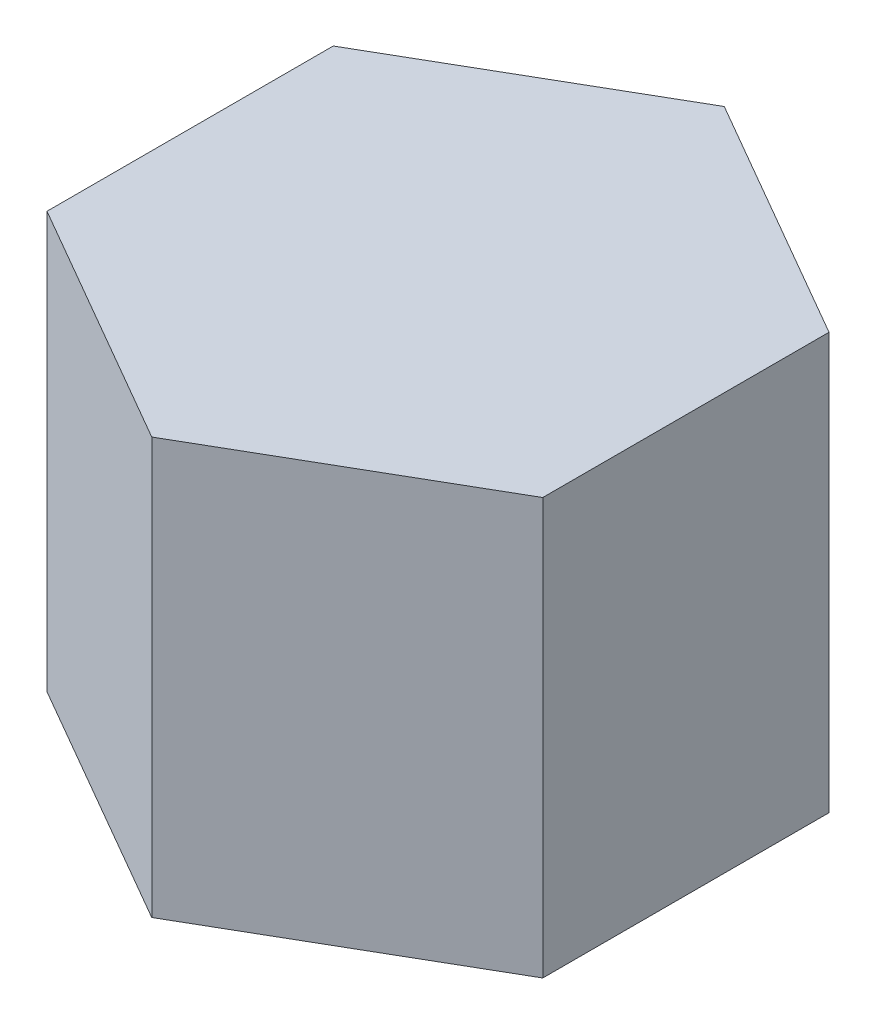
ISO-10303-21;
HEADER;
FILE_DESCRIPTION(('STEP AP214'),'2;1');
FILE_NAME('part.step','',(''),(''),'','','');
FILE_SCHEMA(('AUTOMOTIVE_DESIGN { 1 0 10303 214 1 1 1 1 }'));
ENDSEC;
DATA;
#1=APPLICATION_CONTEXT('core data for automotive mechanical design processes');
#2=APPLICATION_PROTOCOL_DEFINITION('international standard','automotive_design',2000,#1);
#3=PRODUCT_CONTEXT('',#1,'mechanical');
#4=PRODUCT('Part','Part','',(#3));
#5=PRODUCT_RELATED_PRODUCT_CATEGORY('part','',(#4));
#6=PRODUCT_DEFINITION_FORMATION('','',#4);
#7=PRODUCT_DEFINITION_CONTEXT('part definition',#1,'design');
#8=PRODUCT_DEFINITION('design','',#6,#7);
#9=PRODUCT_DEFINITION_SHAPE('','',#8);
#10=(LENGTH_UNIT() NAMED_UNIT(*) SI_UNIT(.MILLI.,.METRE.));
#11=(NAMED_UNIT(*) PLANE_ANGLE_UNIT() SI_UNIT($,.RADIAN.));
#12=(NAMED_UNIT(*) SI_UNIT($,.STERADIAN.) SOLID_ANGLE_UNIT());
#13=UNCERTAINTY_MEASURE_WITH_UNIT(LENGTH_MEASURE(1.E-05),#10,'distance_accuracy_value','');
#14=(GEOMETRIC_REPRESENTATION_CONTEXT(3) GLOBAL_UNCERTAINTY_ASSIGNED_CONTEXT((#13)) GLOBAL_UNIT_ASSIGNED_CONTEXT((#10,
#11,#12)) REPRESENTATION_CONTEXT('',''));
#15=CARTESIAN_POINT('',(0.,0.,0.));
#16=DIRECTION('',(0.,0.,1.));
#17=DIRECTION('',(1.,0.,0.));
#18=AXIS2_PLACEMENT_3D('',#15,#16,#17);
#19=CARTESIAN_POINT('',(201.839551417382,-147.556598747966,294.280047431848));
#20=DIRECTION('',(-0.500000000000096,0.,-0.866025403784383));
#21=DIRECTION('',(-0.866025403784383,0.,0.500000000000096));
#22=AXIS2_PLACEMENT_3D('',#19,#20,#21);
#23=PLANE('',#22);
#24=CARTESIAN_POINT('',(202.142660308706,-147.047793579175,294.105047431848));
#25=DIRECTION('',(-0.866025403784383,0.,0.500000000000096));
#26=VECTOR('',#25,1.);
#27=LINE('',#24,#26);
#28=CARTESIAN_POINT('',(202.142660308706,-147.047793579175,294.105047431848));
#29=VERTEX_POINT('',#28);
#30=CARTESIAN_POINT('',(201.839551417382,-147.047793579175,294.280047431848));
#31=VERTEX_POINT('',#30);
#32=EDGE_CURVE('E170',#29,#31,#27,.T.);
#33=ORIENTED_EDGE('',*,*,#32,.T.);
#34=CARTESIAN_POINT('',(201.839551417382,-147.556598747966,294.280047431848));
#35=DIRECTION('',(0.,1.,0.));
#36=VECTOR('',#35,1.);
#37=LINE('',#34,#36);
#38=CARTESIAN_POINT('',(201.839551417382,-147.556598747966,294.280047431848));
#39=VERTEX_POINT('',#38);
#40=EDGE_CURVE('E35',#39,#31,#37,.T.);
#41=ORIENTED_EDGE('',*,*,#40,.F.);
#42=CARTESIAN_POINT('',(202.142660308706,-147.556598747966,294.105047431848));
#43=DIRECTION('',(-0.866025403784383,0.,0.500000000000096));
#44=VECTOR('',#43,1.);
#45=LINE('',#42,#44);
#46=CARTESIAN_POINT('',(202.142660308706,-147.556598747966,294.105047431848));
#47=VERTEX_POINT('',#46);
#48=EDGE_CURVE('E159',#47,#39,#45,.T.);
#49=ORIENTED_EDGE('',*,*,#48,.F.);
#50=CARTESIAN_POINT('',(202.142660308706,-147.556598747966,294.105047431848));
#51=DIRECTION('',(0.,1.,0.));
#52=VECTOR('',#51,1.);
#53=LINE('',#50,#52);
#54=EDGE_CURVE('E10',#47,#29,#53,.T.);
#55=ORIENTED_EDGE('',*,*,#54,.T.);
#56=EDGE_LOOP('',(#33,#41,#49,#55));
#57=FACE_BOUND('',#56,.T.);
#58=ADVANCED_FACE('F16',(#57),#23,.F.);
#59=CARTESIAN_POINT('',(202.142660308706,-147.556598747966,291.594471220494));
#60=DIRECTION('',(-1.,0.,0.));
#61=DIRECTION('',(0.,-1.,0.));
#62=AXIS2_PLACEMENT_3D('',#59,#60,#61);
#63=PLANE('',#62);
#64=CARTESIAN_POINT('',(202.142660308706,-147.047793579175,293.755047431848));
#65=DIRECTION('',(0.,0.,1.));
#66=VECTOR('',#65,1.);
#67=LINE('',#64,#66);
#68=CARTESIAN_POINT('',(202.142660308706,-147.047793579175,293.755047431848));
#69=VERTEX_POINT('',#68);
#70=EDGE_CURVE('E167',#69,#29,#67,.T.);
#71=ORIENTED_EDGE('',*,*,#70,.T.);
#72=ORIENTED_EDGE('',*,*,#54,.F.);
#73=CARTESIAN_POINT('',(202.142660308706,-147.556598747966,293.755047431848));
#74=DIRECTION('',(0.,0.,1.));
#75=VECTOR('',#74,1.);
#76=LINE('',#73,#75);
#77=CARTESIAN_POINT('',(202.142660308706,-147.556598747966,293.755047431848));
#78=VERTEX_POINT('',#77);
#79=EDGE_CURVE('E156',#78,#47,#76,.T.);
#80=ORIENTED_EDGE('',*,*,#79,.F.);
#81=CARTESIAN_POINT('',(202.142660308706,-147.556598747966,293.755047431848));
#82=DIRECTION('',(0.,1.,0.));
#83=VECTOR('',#82,1.);
#84=LINE('',#81,#83);
#85=EDGE_CURVE('E27',#78,#69,#84,.T.);
#86=ORIENTED_EDGE('',*,*,#85,.T.);
#87=EDGE_LOOP('',(#71,#72,#80,#86));
#88=FACE_BOUND('',#87,.T.);
#89=ADVANCED_FACE('F189',(#88),#63,.F.);
#90=CARTESIAN_POINT('',(202.142660308706,-147.556598747966,293.755047431848));
#91=DIRECTION('',(-0.499999999999909,0.,0.866025403784491));
#92=DIRECTION('',(0.866025403784491,0.,0.499999999999909));
#93=AXIS2_PLACEMENT_3D('',#90,#91,#92);
#94=PLANE('',#93);
#95=CARTESIAN_POINT('',(201.839551417381,-147.047793579175,293.580047431848));
#96=DIRECTION('',(0.866025403784491,0.,0.499999999999909));
#97=VECTOR('',#96,1.);
#98=LINE('',#95,#97);
#99=CARTESIAN_POINT('',(201.839551417382,-147.047793579175,293.580047431848));
#100=VERTEX_POINT('',#99);
#101=EDGE_CURVE('E163',#100,#69,#98,.T.);
#102=ORIENTED_EDGE('',*,*,#101,.T.);
#103=ORIENTED_EDGE('',*,*,#85,.F.);
#104=CARTESIAN_POINT('',(201.839551417381,-147.556598747966,293.580047431848));
#105=DIRECTION('',(0.866025403784491,0.,0.499999999999909));
#106=VECTOR('',#105,1.);
#107=LINE('',#104,#106);
#108=CARTESIAN_POINT('',(201.839551417382,-147.556598747966,293.580047431848));
#109=VERTEX_POINT('',#108);
#110=EDGE_CURVE('E106',#109,#78,#107,.T.);
#111=ORIENTED_EDGE('',*,*,#110,.F.);
#112=CARTESIAN_POINT('',(201.839551417381,-147.556598747966,293.580047431848));
#113=DIRECTION('',(0.,1.,0.));
#114=VECTOR('',#113,1.);
#115=LINE('',#112,#114);
#116=EDGE_CURVE('E94',#109,#100,#115,.T.);
#117=ORIENTED_EDGE('',*,*,#116,.T.);
#118=EDGE_LOOP('',(#102,#103,#111,#117));
#119=FACE_BOUND('',#118,.T.);
#120=ADVANCED_FACE('F198',(#119),#94,.F.);
#121=CARTESIAN_POINT('',(201.839551417382,-147.556598747966,293.580047431848));
#122=DIRECTION('',(0.500000000000096,0.,0.866025403784383));
#123=DIRECTION('',(0.866025403784383,0.,-0.500000000000096));
#124=AXIS2_PLACEMENT_3D('',#121,#122,#123);
#125=PLANE('',#124);
#126=CARTESIAN_POINT('',(201.536442526057,-147.047793579175,293.755047431848));
#127=DIRECTION('',(0.866025403784383,0.,-0.500000000000096));
#128=VECTOR('',#127,1.);
#129=LINE('',#126,#128);
#130=CARTESIAN_POINT('',(201.536442526057,-147.047793579175,293.755047431848));
#131=VERTEX_POINT('',#130);
#132=EDGE_CURVE('E162',#131,#100,#129,.T.);
#133=ORIENTED_EDGE('',*,*,#132,.T.);
#134=ORIENTED_EDGE('',*,*,#116,.F.);
#135=CARTESIAN_POINT('',(201.536442526057,-147.556598747966,293.755047431848));
#136=DIRECTION('',(0.866025403784383,0.,-0.500000000000096));
#137=VECTOR('',#136,1.);
#138=LINE('',#135,#137);
#139=CARTESIAN_POINT('',(201.536442526057,-147.556598747966,293.755047431848));
#140=VERTEX_POINT('',#139);
#141=EDGE_CURVE('E98',#140,#109,#138,.T.);
#142=ORIENTED_EDGE('',*,*,#141,.F.);
#143=CARTESIAN_POINT('',(201.536442526057,-147.556598747966,293.755047431848));
#144=DIRECTION('',(0.,1.,0.));
#145=VECTOR('',#144,1.);
#146=LINE('',#143,#145);
#147=EDGE_CURVE('E79',#140,#131,#146,.T.);
#148=ORIENTED_EDGE('',*,*,#147,.T.);
#149=EDGE_LOOP('',(#133,#134,#142,#148));
#150=FACE_BOUND('',#149,.T.);
#151=ADVANCED_FACE('F100',(#150),#125,.F.);
#152=CARTESIAN_POINT('',(201.536442526057,-147.556598747966,291.594471220494));
#153=DIRECTION('',(1.,0.,0.));
#154=DIRECTION('',(0.,1.,0.));
#155=AXIS2_PLACEMENT_3D('',#152,#153,#154);
#156=PLANE('',#155);
#157=CARTESIAN_POINT('',(201.536442526057,-147.047793579175,294.105047431848));
#158=DIRECTION('',(0.,0.,-1.));
#159=VECTOR('',#158,1.);
#160=LINE('',#157,#159);
#161=CARTESIAN_POINT('',(201.536442526057,-147.047793579175,294.105047431848));
#162=VERTEX_POINT('',#161);
#163=EDGE_CURVE('E88',#162,#131,#160,.T.);
#164=ORIENTED_EDGE('',*,*,#163,.T.);
#165=ORIENTED_EDGE('',*,*,#147,.F.);
#166=CARTESIAN_POINT('',(201.536442526057,-147.556598747966,294.105047431848));
#167=DIRECTION('',(0.,0.,-1.));
#168=VECTOR('',#167,1.);
#169=LINE('',#166,#168);
#170=CARTESIAN_POINT('',(201.536442526057,-147.556598747966,294.105047431848));
#171=VERTEX_POINT('',#170);
#172=EDGE_CURVE('E84',#171,#140,#169,.T.);
#173=ORIENTED_EDGE('',*,*,#172,.F.);
#174=CARTESIAN_POINT('',(201.536442526057,-147.556598747966,294.105047431848));
#175=DIRECTION('',(0.,1.,0.));
#176=VECTOR('',#175,1.);
#177=LINE('',#174,#176);
#178=EDGE_CURVE('E58',#171,#162,#177,.T.);
#179=ORIENTED_EDGE('',*,*,#178,.T.);
#180=EDGE_LOOP('',(#164,#165,#173,#179));
#181=FACE_BOUND('',#180,.T.);
#182=ADVANCED_FACE('F82',(#181),#156,.F.);
#183=CARTESIAN_POINT('',(201.536442526057,-147.556598747966,294.105047431848));
#184=DIRECTION('',(0.499999999999978,0.,-0.866025403784452));
#185=DIRECTION('',(-0.866025403784452,0.,-0.499999999999978));
#186=AXIS2_PLACEMENT_3D('',#183,#184,#185);
#187=PLANE('',#186);
#188=CARTESIAN_POINT('',(201.839551417382,-147.047793579175,294.280047431848));
#189=DIRECTION('',(-0.866025403784452,0.,-0.499999999999978));
#190=VECTOR('',#189,1.);
#191=LINE('',#188,#190);
#192=EDGE_CURVE('E160',#31,#162,#191,.T.);
#193=ORIENTED_EDGE('',*,*,#192,.T.);
#194=ORIENTED_EDGE('',*,*,#178,.F.);
#195=CARTESIAN_POINT('',(201.839551417382,-147.556598747966,294.280047431848));
#196=DIRECTION('',(-0.866025403784452,0.,-0.499999999999978));
#197=VECTOR('',#196,1.);
#198=LINE('',#195,#197);
#199=EDGE_CURVE('E112',#39,#171,#198,.T.);
#200=ORIENTED_EDGE('',*,*,#199,.F.);
#201=ORIENTED_EDGE('',*,*,#40,.T.);
#202=EDGE_LOOP('',(#193,#194,#200,#201));
#203=FACE_BOUND('',#202,.T.);
#204=ADVANCED_FACE('F131',(#203),#187,.F.);
#205=CARTESIAN_POINT('',(206.491105863044,-147.556598747966,291.594471220494));
#206=DIRECTION('',(0.,1.,0.));
#207=DIRECTION('',(-1.,0.,0.));
#208=AXIS2_PLACEMENT_3D('',#205,#206,#207);
#209=PLANE('',#208);
#210=ORIENTED_EDGE('',*,*,#48,.T.);
#211=ORIENTED_EDGE('',*,*,#199,.T.);
#212=ORIENTED_EDGE('',*,*,#172,.T.);
#213=ORIENTED_EDGE('',*,*,#141,.T.);
#214=ORIENTED_EDGE('',*,*,#110,.T.);
#215=ORIENTED_EDGE('',*,*,#79,.T.);
#216=EDGE_LOOP('',(#210,#211,#212,#213,#214,#215));
#217=FACE_BOUND('',#216,.T.);
#218=ADVANCED_FACE('F111',(#217),#209,.F.);
#219=CARTESIAN_POINT('',(206.491105863044,-147.047793579175,291.594471220494));
#220=DIRECTION('',(0.,1.,0.));
#221=DIRECTION('',(-1.,0.,0.));
#222=AXIS2_PLACEMENT_3D('',#219,#220,#221);
#223=PLANE('',#222);
#224=ORIENTED_EDGE('',*,*,#32,.F.);
#225=ORIENTED_EDGE('',*,*,#70,.F.);
#226=ORIENTED_EDGE('',*,*,#101,.F.);
#227=ORIENTED_EDGE('',*,*,#132,.F.);
#228=ORIENTED_EDGE('',*,*,#163,.F.);
#229=ORIENTED_EDGE('',*,*,#192,.F.);
#230=EDGE_LOOP('',(#224,#225,#226,#227,#228,#229));
#231=FACE_BOUND('',#230,.T.);
#232=ADVANCED_FACE('F130',(#231),#223,.T.);
#233=CLOSED_SHELL('',(#58,#89,#120,#151,#182,#204,#218,#232));
#234=MANIFOLD_SOLID_BREP('B1',#233);
#235=ADVANCED_BREP_SHAPE_REPRESENTATION('',(#18,#234),#14);
#236=SHAPE_DEFINITION_REPRESENTATION(#9,#235);
ENDSEC;
END-ISO-10303-21;
